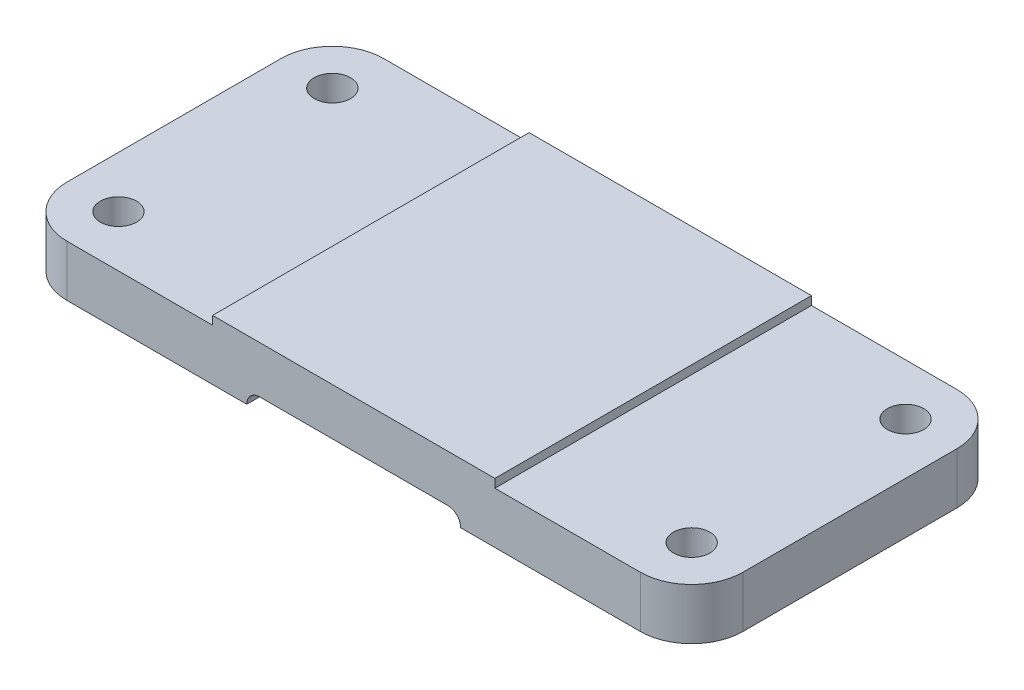
ISO-10303-21;
HEADER;
FILE_DESCRIPTION(('STEP AP214'),'2;1');
FILE_NAME('part.step','',(''),(''),'','','');
FILE_SCHEMA(('AUTOMOTIVE_DESIGN { 1 0 10303 214 1 1 1 1 }'));
ENDSEC;
DATA;
#1=APPLICATION_CONTEXT('core data for automotive mechanical design processes');
#2=APPLICATION_PROTOCOL_DEFINITION('international standard','automotive_design',2000,#1);
#3=PRODUCT_CONTEXT('',#1,'mechanical');
#4=PRODUCT('Part','Part','',(#3));
#5=PRODUCT_RELATED_PRODUCT_CATEGORY('part','',(#4));
#6=PRODUCT_DEFINITION_FORMATION('','',#4);
#7=PRODUCT_DEFINITION_CONTEXT('part definition',#1,'design');
#8=PRODUCT_DEFINITION('design','',#6,#7);
#9=PRODUCT_DEFINITION_SHAPE('','',#8);
#10=(LENGTH_UNIT() NAMED_UNIT(*) SI_UNIT(.MILLI.,.METRE.));
#11=(NAMED_UNIT(*) PLANE_ANGLE_UNIT() SI_UNIT($,.RADIAN.));
#12=(NAMED_UNIT(*) SI_UNIT($,.STERADIAN.) SOLID_ANGLE_UNIT());
#13=UNCERTAINTY_MEASURE_WITH_UNIT(LENGTH_MEASURE(1.E-05),#10,'distance_accuracy_value','');
#14=(GEOMETRIC_REPRESENTATION_CONTEXT(3) GLOBAL_UNCERTAINTY_ASSIGNED_CONTEXT((#13)) GLOBAL_UNIT_ASSIGNED_CONTEXT((#10,
#11,#12)) REPRESENTATION_CONTEXT('',''));
#15=CARTESIAN_POINT('',(0.,0.,0.));
#16=DIRECTION('',(0.,0.,1.));
#17=DIRECTION('',(1.,0.,0.));
#18=AXIS2_PLACEMENT_3D('',#15,#16,#17);
#19=CARTESIAN_POINT('',(0.,12.,0.));
#20=DIRECTION('',(0.,0.,-1.));
#21=DIRECTION('',(-1.,0.,0.));
#22=AXIS2_PLACEMENT_3D('',#19,#20,#21);
#23=PLANE('',#22);
#24=DIRECTION('',(1.,0.,0.));
#25=VECTOR('',#24,1.);
#26=CARTESIAN_POINT('',(0.,0.,0.));
#27=LINE('',#26,#25);
#28=CARTESIAN_POINT('',(12.0000000000001,0.,0.));
#29=VERTEX_POINT('',#28);
#30=CARTESIAN_POINT('',(54.,0.,0.));
#31=VERTEX_POINT('',#30);
#32=EDGE_CURVE('E174',#29,#31,#27,.T.);
#33=ORIENTED_EDGE('',*,*,#32,.T.);
#34=CARTESIAN_POINT('',(57.,0.,0.));
#35=DIRECTION('',(0.,0.,-1.));
#36=DIRECTION('',(-1.,0.,0.));
#37=AXIS2_PLACEMENT_3D('',#34,#35,#36);
#38=CIRCLE('',#37,3.);
#39=CARTESIAN_POINT('',(57.,3.,0.));
#40=VERTEX_POINT('',#39);
#41=EDGE_CURVE('E12',#31,#40,#38,.T.);
#42=ORIENTED_EDGE('',*,*,#41,.T.);
#43=DIRECTION('',(-1.,0.,0.));
#44=VECTOR('',#43,1.);
#45=CARTESIAN_POINT('',(104.,3.,0.));
#46=LINE('',#45,#44);
#47=CARTESIAN_POINT('',(101.,3.,0.));
#48=VERTEX_POINT('',#47);
#49=EDGE_CURVE('E161',#48,#40,#46,.T.);
#50=ORIENTED_EDGE('',*,*,#49,.F.);
#51=CARTESIAN_POINT('',(101.,0.,0.));
#52=DIRECTION('',(0.,0.,-1.));
#53=DIRECTION('',(-1.,0.,0.));
#54=AXIS2_PLACEMENT_3D('',#51,#52,#53);
#55=CIRCLE('',#54,3.);
#56=CARTESIAN_POINT('',(104.,0.,0.));
#57=VERTEX_POINT('',#56);
#58=EDGE_CURVE('E67',#48,#57,#55,.T.);
#59=ORIENTED_EDGE('',*,*,#58,.T.);
#60=CARTESIAN_POINT('',(146.,0.,0.));
#61=VERTEX_POINT('',#60);
#62=EDGE_CURVE('E159',#57,#61,#27,.T.);
#63=ORIENTED_EDGE('',*,*,#62,.T.);
#64=DIRECTION('',(0.,-1.,0.));
#65=VECTOR('',#64,1.);
#66=CARTESIAN_POINT('',(146.,12.,0.));
#67=LINE('',#66,#65);
#68=CARTESIAN_POINT('',(146.,12.,0.));
#69=VERTEX_POINT('',#68);
#70=EDGE_CURVE('E407',#69,#61,#67,.T.);
#71=ORIENTED_EDGE('',*,*,#70,.F.);
#72=DIRECTION('',(1.,0.,0.));
#73=VECTOR('',#72,1.);
#74=CARTESIAN_POINT('',(0.,12.,0.));
#75=LINE('',#74,#73);
#76=CARTESIAN_POINT('',(112.,12.,0.));
#77=VERTEX_POINT('',#76);
#78=EDGE_CURVE('E421',#77,#69,#75,.T.);
#79=ORIENTED_EDGE('',*,*,#78,.F.);
#80=DIRECTION('',(0.,1.,0.));
#81=VECTOR('',#80,1.);
#82=CARTESIAN_POINT('',(112.,12.,0.));
#83=LINE('',#82,#81);
#84=CARTESIAN_POINT('',(112.,14.,0.));
#85=VERTEX_POINT('',#84);
#86=EDGE_CURVE('E448',#77,#85,#83,.T.);
#87=ORIENTED_EDGE('',*,*,#86,.T.);
#88=DIRECTION('',(-1.,0.,0.));
#89=VECTOR('',#88,1.);
#90=CARTESIAN_POINT('',(112.,14.,0.));
#91=LINE('',#90,#89);
#92=CARTESIAN_POINT('',(46.,14.,0.));
#93=VERTEX_POINT('',#92);
#94=EDGE_CURVE('E401',#85,#93,#91,.T.);
#95=ORIENTED_EDGE('',*,*,#94,.T.);
#96=DIRECTION('',(0.,1.,0.));
#97=VECTOR('',#96,1.);
#98=CARTESIAN_POINT('',(46.,12.,0.));
#99=LINE('',#98,#97);
#100=CARTESIAN_POINT('',(46.,12.,0.));
#101=VERTEX_POINT('',#100);
#102=EDGE_CURVE('E460',#101,#93,#99,.T.);
#103=ORIENTED_EDGE('',*,*,#102,.F.);
#104=CARTESIAN_POINT('',(12.0000000000001,12.,0.));
#105=VERTEX_POINT('',#104);
#106=EDGE_CURVE('E418',#105,#101,#75,.T.);
#107=ORIENTED_EDGE('',*,*,#106,.F.);
#108=DIRECTION('',(0.,-1.,0.));
#109=VECTOR('',#108,1.);
#110=CARTESIAN_POINT('',(12.0000000000001,12.,0.));
#111=LINE('',#110,#109);
#112=EDGE_CURVE('E206',#105,#29,#111,.T.);
#113=ORIENTED_EDGE('',*,*,#112,.T.);
#114=EDGE_LOOP('',(#33,#42,#50,#59,#63,#71,#79,#87,#95,#103,#107,#113));
#115=FACE_BOUND('',#114,.T.);
#116=ADVANCED_FACE('F43',(#115),#23,.F.);
#117=CARTESIAN_POINT('',(0.,12.,-74.));
#118=DIRECTION('',(0.,0.,-1.));
#119=DIRECTION('',(-1.,0.,0.));
#120=AXIS2_PLACEMENT_3D('',#117,#118,#119);
#121=PLANE('',#120);
#122=DIRECTION('',(1.,0.,0.));
#123=VECTOR('',#122,1.);
#124=CARTESIAN_POINT('',(54.,3.,-74.));
#125=LINE('',#124,#123);
#126=CARTESIAN_POINT('',(57.,3.,-74.));
#127=VERTEX_POINT('',#126);
#128=CARTESIAN_POINT('',(101.,3.,-74.));
#129=VERTEX_POINT('',#128);
#130=EDGE_CURVE('E180',#127,#129,#125,.T.);
#131=ORIENTED_EDGE('',*,*,#130,.F.);
#132=CARTESIAN_POINT('',(57.,0.,-74.));
#133=DIRECTION('',(0.,0.,-1.));
#134=DIRECTION('',(-1.,0.,0.));
#135=AXIS2_PLACEMENT_3D('',#132,#133,#134);
#136=CIRCLE('',#135,3.);
#137=CARTESIAN_POINT('',(54.,0.,-74.));
#138=VERTEX_POINT('',#137);
#139=EDGE_CURVE('E53',#127,#138,#136,.F.);
#140=ORIENTED_EDGE('',*,*,#139,.T.);
#141=DIRECTION('',(1.,0.,0.));
#142=VECTOR('',#141,1.);
#143=CARTESIAN_POINT('',(0.,0.,-74.));
#144=LINE('',#143,#142);
#145=CARTESIAN_POINT('',(12.0000000000001,0.,-74.));
#146=VERTEX_POINT('',#145);
#147=EDGE_CURVE('E224',#146,#138,#144,.T.);
#148=ORIENTED_EDGE('',*,*,#147,.F.);
#149=DIRECTION('',(0.,-1.,0.));
#150=VECTOR('',#149,1.);
#151=CARTESIAN_POINT('',(12.0000000000001,12.,-74.));
#152=LINE('',#151,#150);
#153=CARTESIAN_POINT('',(12.0000000000001,12.,-74.));
#154=VERTEX_POINT('',#153);
#155=EDGE_CURVE('E512',#154,#146,#152,.T.);
#156=ORIENTED_EDGE('',*,*,#155,.F.);
#157=DIRECTION('',(1.,0.,0.));
#158=VECTOR('',#157,1.);
#159=CARTESIAN_POINT('',(0.,12.,-74.));
#160=LINE('',#159,#158);
#161=CARTESIAN_POINT('',(46.,12.,-74.));
#162=VERTEX_POINT('',#161);
#163=EDGE_CURVE('E382',#154,#162,#160,.T.);
#164=ORIENTED_EDGE('',*,*,#163,.T.);
#165=DIRECTION('',(0.,1.,0.));
#166=VECTOR('',#165,1.);
#167=CARTESIAN_POINT('',(46.,12.,-74.));
#168=LINE('',#167,#166);
#169=CARTESIAN_POINT('',(46.,14.,-74.));
#170=VERTEX_POINT('',#169);
#171=EDGE_CURVE('E481',#162,#170,#168,.T.);
#172=ORIENTED_EDGE('',*,*,#171,.T.);
#173=DIRECTION('',(1.,0.,0.));
#174=VECTOR('',#173,1.);
#175=CARTESIAN_POINT('',(46.,14.,-74.));
#176=LINE('',#175,#174);
#177=CARTESIAN_POINT('',(112.,14.,-74.));
#178=VERTEX_POINT('',#177);
#179=EDGE_CURVE('E442',#170,#178,#176,.T.);
#180=ORIENTED_EDGE('',*,*,#179,.T.);
#181=DIRECTION('',(0.,1.,0.));
#182=VECTOR('',#181,1.);
#183=CARTESIAN_POINT('',(112.,12.,-74.));
#184=LINE('',#183,#182);
#185=CARTESIAN_POINT('',(112.,12.,-74.));
#186=VERTEX_POINT('',#185);
#187=EDGE_CURVE('E440',#186,#178,#184,.T.);
#188=ORIENTED_EDGE('',*,*,#187,.F.);
#189=CARTESIAN_POINT('',(146.,12.,-74.));
#190=VERTEX_POINT('',#189);
#191=EDGE_CURVE('E378',#186,#190,#160,.T.);
#192=ORIENTED_EDGE('',*,*,#191,.T.);
#193=DIRECTION('',(0.,-1.,0.));
#194=VECTOR('',#193,1.);
#195=CARTESIAN_POINT('',(146.,12.,-74.));
#196=LINE('',#195,#194);
#197=CARTESIAN_POINT('',(146.,0.,-74.));
#198=VERTEX_POINT('',#197);
#199=EDGE_CURVE('E434',#190,#198,#196,.T.);
#200=ORIENTED_EDGE('',*,*,#199,.T.);
#201=CARTESIAN_POINT('',(104.,0.,-74.));
#202=VERTEX_POINT('',#201);
#203=EDGE_CURVE('E236',#202,#198,#144,.T.);
#204=ORIENTED_EDGE('',*,*,#203,.F.);
#205=CARTESIAN_POINT('',(101.,0.,-74.));
#206=DIRECTION('',(0.,0.,-1.));
#207=DIRECTION('',(-1.,0.,0.));
#208=AXIS2_PLACEMENT_3D('',#205,#206,#207);
#209=CIRCLE('',#208,3.);
#210=EDGE_CURVE('E163',#202,#129,#209,.F.);
#211=ORIENTED_EDGE('',*,*,#210,.T.);
#212=EDGE_LOOP('',(#131,#140,#148,#156,#164,#172,#180,#188,#192,#200,#204,#211));
#213=FACE_BOUND('',#212,.T.);
#214=ADVANCED_FACE('F223',(#213),#121,.T.);
#215=CARTESIAN_POINT('',(0.,0.,0.));
#216=DIRECTION('',(0.,1.,0.));
#217=DIRECTION('',(0.,0.,1.));
#218=AXIS2_PLACEMENT_3D('',#215,#216,#217);
#219=PLANE('',#218);
#220=CARTESIAN_POINT('',(12.,0.,-12.));
#221=DIRECTION('',(0.,1.,0.));
#222=DIRECTION('',(0.,0.,1.));
#223=AXIS2_PLACEMENT_3D('',#220,#221,#222);
#224=CIRCLE('',#223,4.24999999999999);
#225=CARTESIAN_POINT('',(12.,0.,-7.75000000000001));
#226=VERTEX_POINT('',#225);
#227=EDGE_CURVE('E248',#226,#226,#224,.T.);
#228=ORIENTED_EDGE('',*,*,#227,.T.);
#229=EDGE_LOOP('',(#228));
#230=FACE_BOUND('',#229,.T.);
#231=CARTESIAN_POINT('',(12.,0.,-62.));
#232=DIRECTION('',(0.,1.,0.));
#233=DIRECTION('',(0.,0.,1.));
#234=AXIS2_PLACEMENT_3D('',#231,#232,#233);
#235=CIRCLE('',#234,4.24999999999999);
#236=CARTESIAN_POINT('',(12.,0.,-57.75));
#237=VERTEX_POINT('',#236);
#238=EDGE_CURVE('E239',#237,#237,#235,.T.);
#239=ORIENTED_EDGE('',*,*,#238,.T.);
#240=EDGE_LOOP('',(#239));
#241=FACE_BOUND('',#240,.T.);
#242=DIRECTION('',(0.,0.,-1.));
#243=VECTOR('',#242,1.);
#244=CARTESIAN_POINT('',(54.,0.,0.));
#245=LINE('',#244,#243);
#246=EDGE_CURVE('E187',#31,#138,#245,.T.);
#247=ORIENTED_EDGE('',*,*,#246,.F.);
#248=ORIENTED_EDGE('',*,*,#32,.F.);
#249=CARTESIAN_POINT('',(12.,0.,-12.));
#250=DIRECTION('',(0.,1.,0.));
#251=DIRECTION('',(0.,0.,1.));
#252=AXIS2_PLACEMENT_3D('',#249,#250,#251);
#253=CIRCLE('',#252,12.);
#254=CARTESIAN_POINT('',(0.,0.,-12.0000000000001));
#255=VERTEX_POINT('',#254);
#256=EDGE_CURVE('E175',#29,#255,#253,.F.);
#257=ORIENTED_EDGE('',*,*,#256,.T.);
#258=DIRECTION('',(0.,0.,-1.));
#259=VECTOR('',#258,1.);
#260=CARTESIAN_POINT('',(0.,0.,0.));
#261=LINE('',#260,#259);
#262=CARTESIAN_POINT('',(0.,0.,-61.9999999999999));
#263=VERTEX_POINT('',#262);
#264=EDGE_CURVE('E500',#255,#263,#261,.T.);
#265=ORIENTED_EDGE('',*,*,#264,.T.);
#266=CARTESIAN_POINT('',(12.,0.,-62.));
#267=DIRECTION('',(0.,1.,0.));
#268=DIRECTION('',(0.,0.,1.));
#269=AXIS2_PLACEMENT_3D('',#266,#267,#268);
#270=CIRCLE('',#269,12.);
#271=EDGE_CURVE('E234',#263,#146,#270,.F.);
#272=ORIENTED_EDGE('',*,*,#271,.T.);
#273=ORIENTED_EDGE('',*,*,#147,.T.);
#274=EDGE_LOOP('',(#247,#248,#257,#265,#272,#273));
#275=FACE_BOUND('',#274,.T.);
#276=ADVANCED_FACE('F230',(#230,#241,#275),#219,.F.);
#277=CARTESIAN_POINT('',(146.,0.,-12.));
#278=DIRECTION('',(0.,1.,0.));
#279=DIRECTION('',(0.,0.,1.));
#280=AXIS2_PLACEMENT_3D('',#277,#278,#279);
#281=CIRCLE('',#280,4.24999999999998);
#282=CARTESIAN_POINT('',(146.,0.,-7.75000000000003));
#283=VERTEX_POINT('',#282);
#284=EDGE_CURVE('E47',#283,#283,#281,.T.);
#285=ORIENTED_EDGE('',*,*,#284,.T.);
#286=EDGE_LOOP('',(#285));
#287=FACE_BOUND('',#286,.T.);
#288=CARTESIAN_POINT('',(146.,0.,-62.));
#289=DIRECTION('',(0.,1.,0.));
#290=DIRECTION('',(0.,0.,1.));
#291=AXIS2_PLACEMENT_3D('',#288,#289,#290);
#292=CIRCLE('',#291,4.24999999999998);
#293=CARTESIAN_POINT('',(146.,0.,-57.75));
#294=VERTEX_POINT('',#293);
#295=EDGE_CURVE('E256',#294,#294,#292,.T.);
#296=ORIENTED_EDGE('',*,*,#295,.T.);
#297=EDGE_LOOP('',(#296));
#298=FACE_BOUND('',#297,.T.);
#299=DIRECTION('',(0.,0.,1.));
#300=VECTOR('',#299,1.);
#301=CARTESIAN_POINT('',(104.,0.,-74.));
#302=LINE('',#301,#300);
#303=EDGE_CURVE('E169',#202,#57,#302,.T.);
#304=ORIENTED_EDGE('',*,*,#303,.F.);
#305=ORIENTED_EDGE('',*,*,#203,.T.);
#306=CARTESIAN_POINT('',(146.,0.,-62.));
#307=DIRECTION('',(0.,1.,0.));
#308=DIRECTION('',(0.,0.,1.));
#309=AXIS2_PLACEMENT_3D('',#306,#307,#308);
#310=CIRCLE('',#309,12.);
#311=CARTESIAN_POINT('',(158.,0.,-61.9999999999999));
#312=VERTEX_POINT('',#311);
#313=EDGE_CURVE('E362',#198,#312,#310,.F.);
#314=ORIENTED_EDGE('',*,*,#313,.T.);
#315=DIRECTION('',(0.,0.,-1.));
#316=VECTOR('',#315,1.);
#317=CARTESIAN_POINT('',(158.,0.,0.));
#318=LINE('',#317,#316);
#319=CARTESIAN_POINT('',(158.,0.,-12.0000000000001));
#320=VERTEX_POINT('',#319);
#321=EDGE_CURVE('E354',#320,#312,#318,.T.);
#322=ORIENTED_EDGE('',*,*,#321,.F.);
#323=CARTESIAN_POINT('',(146.,0.,-12.));
#324=DIRECTION('',(0.,1.,0.));
#325=DIRECTION('',(0.,0.,1.));
#326=AXIS2_PLACEMENT_3D('',#323,#324,#325);
#327=CIRCLE('',#326,12.);
#328=EDGE_CURVE('E172',#61,#320,#327,.T.);
#329=ORIENTED_EDGE('',*,*,#328,.F.);
#330=ORIENTED_EDGE('',*,*,#62,.F.);
#331=EDGE_LOOP('',(#304,#305,#314,#322,#329,#330));
#332=FACE_BOUND('',#331,.T.);
#333=ADVANCED_FACE('F168',(#287,#298,#332),#219,.F.);
#334=CARTESIAN_POINT('',(0.,12.,0.));
#335=DIRECTION('',(0.,1.,0.));
#336=DIRECTION('',(0.,0.,1.));
#337=AXIS2_PLACEMENT_3D('',#334,#335,#336);
#338=PLANE('',#337);
#339=CARTESIAN_POINT('',(12.,12.,-12.));
#340=DIRECTION('',(0.,1.,0.));
#341=DIRECTION('',(0.,0.,1.));
#342=AXIS2_PLACEMENT_3D('',#339,#340,#341);
#343=CIRCLE('',#342,4.24999999999999);
#344=CARTESIAN_POINT('',(12.,12.,-7.75000000000001));
#345=VERTEX_POINT('',#344);
#346=EDGE_CURVE('E252',#345,#345,#343,.T.);
#347=ORIENTED_EDGE('',*,*,#346,.F.);
#348=EDGE_LOOP('',(#347));
#349=FACE_BOUND('',#348,.T.);
#350=CARTESIAN_POINT('',(12.,12.,-62.));
#351=DIRECTION('',(0.,1.,0.));
#352=DIRECTION('',(0.,0.,1.));
#353=AXIS2_PLACEMENT_3D('',#350,#351,#352);
#354=CIRCLE('',#353,4.24999999999999);
#355=CARTESIAN_POINT('',(12.,12.,-57.75));
#356=VERTEX_POINT('',#355);
#357=EDGE_CURVE('E242',#356,#356,#354,.T.);
#358=ORIENTED_EDGE('',*,*,#357,.F.);
#359=EDGE_LOOP('',(#358));
#360=FACE_BOUND('',#359,.T.);
#361=ORIENTED_EDGE('',*,*,#106,.T.);
#362=DIRECTION('',(0.,0.,-1.));
#363=VECTOR('',#362,1.);
#364=CARTESIAN_POINT('',(46.,12.,0.));
#365=LINE('',#364,#363);
#366=EDGE_CURVE('E457',#101,#162,#365,.T.);
#367=ORIENTED_EDGE('',*,*,#366,.T.);
#368=ORIENTED_EDGE('',*,*,#163,.F.);
#369=CARTESIAN_POINT('',(12.,12.,-62.));
#370=DIRECTION('',(0.,1.,0.));
#371=DIRECTION('',(0.,0.,1.));
#372=AXIS2_PLACEMENT_3D('',#369,#370,#371);
#373=CIRCLE('',#372,12.);
#374=CARTESIAN_POINT('',(0.,12.,-61.9999999999999));
#375=VERTEX_POINT('',#374);
#376=EDGE_CURVE('E389',#375,#154,#373,.F.);
#377=ORIENTED_EDGE('',*,*,#376,.F.);
#378=DIRECTION('',(0.,0.,-1.));
#379=VECTOR('',#378,1.);
#380=CARTESIAN_POINT('',(0.,12.,0.));
#381=LINE('',#380,#379);
#382=CARTESIAN_POINT('',(0.,12.,-12.0000000000001));
#383=VERTEX_POINT('',#382);
#384=EDGE_CURVE('E394',#383,#375,#381,.T.);
#385=ORIENTED_EDGE('',*,*,#384,.F.);
#386=CARTESIAN_POINT('',(12.,12.,-12.));
#387=DIRECTION('',(0.,1.,0.));
#388=DIRECTION('',(0.,0.,1.));
#389=AXIS2_PLACEMENT_3D('',#386,#387,#388);
#390=CIRCLE('',#389,12.);
#391=EDGE_CURVE('E425',#105,#383,#390,.F.);
#392=ORIENTED_EDGE('',*,*,#391,.F.);
#393=EDGE_LOOP('',(#361,#367,#368,#377,#385,#392));
#394=FACE_BOUND('',#393,.T.);
#395=ADVANCED_FACE('F297',(#349,#360,#394),#338,.T.);
#396=CARTESIAN_POINT('',(12.,12.,-12.));
#397=DIRECTION('',(0.,-1.,0.));
#398=DIRECTION('',(0.,0.,-1.));
#399=AXIS2_PLACEMENT_3D('',#396,#397,#398);
#400=CYLINDRICAL_SURFACE('',#399,12.);
#401=ORIENTED_EDGE('',*,*,#256,.F.);
#402=ORIENTED_EDGE('',*,*,#112,.F.);
#403=ORIENTED_EDGE('',*,*,#391,.T.);
#404=DIRECTION('',(0.,-1.,0.));
#405=VECTOR('',#404,1.);
#406=CARTESIAN_POINT('',(0.,12.,-12.0000000000001));
#407=LINE('',#406,#405);
#408=EDGE_CURVE('E398',#383,#255,#407,.T.);
#409=ORIENTED_EDGE('',*,*,#408,.T.);
#410=EDGE_LOOP('',(#401,#402,#403,#409));
#411=FACE_BOUND('',#410,.T.);
#412=ADVANCED_FACE('F295',(#411),#400,.T.);
#413=CARTESIAN_POINT('',(146.,12.,-12.));
#414=DIRECTION('',(0.,-1.,0.));
#415=DIRECTION('',(0.,0.,-1.));
#416=AXIS2_PLACEMENT_3D('',#413,#414,#415);
#417=CYLINDRICAL_SURFACE('',#416,12.);
#418=ORIENTED_EDGE('',*,*,#328,.T.);
#419=DIRECTION('',(0.,-1.,0.));
#420=VECTOR('',#419,1.);
#421=CARTESIAN_POINT('',(158.,12.,-12.0000000000001));
#422=LINE('',#421,#420);
#423=CARTESIAN_POINT('',(158.,12.,-12.0000000000001));
#424=VERTEX_POINT('',#423);
#425=EDGE_CURVE('E360',#424,#320,#422,.T.);
#426=ORIENTED_EDGE('',*,*,#425,.F.);
#427=CARTESIAN_POINT('',(146.,12.,-12.));
#428=DIRECTION('',(0.,1.,0.));
#429=DIRECTION('',(0.,0.,1.));
#430=AXIS2_PLACEMENT_3D('',#427,#428,#429);
#431=CIRCLE('',#430,12.);
#432=EDGE_CURVE('E408',#69,#424,#431,.T.);
#433=ORIENTED_EDGE('',*,*,#432,.F.);
#434=ORIENTED_EDGE('',*,*,#70,.T.);
#435=EDGE_LOOP('',(#418,#426,#433,#434));
#436=FACE_BOUND('',#435,.T.);
#437=ADVANCED_FACE('F293',(#436),#417,.T.);
#438=CARTESIAN_POINT('',(158.,12.,0.));
#439=DIRECTION('',(-1.,0.,0.));
#440=DIRECTION('',(0.,0.,1.));
#441=AXIS2_PLACEMENT_3D('',#438,#439,#440);
#442=PLANE('',#441);
#443=ORIENTED_EDGE('',*,*,#321,.T.);
#444=DIRECTION('',(0.,-1.,0.));
#445=VECTOR('',#444,1.);
#446=CARTESIAN_POINT('',(158.,12.,-61.9999999999999));
#447=LINE('',#446,#445);
#448=CARTESIAN_POINT('',(158.,12.,-61.9999999999999));
#449=VERTEX_POINT('',#448);
#450=EDGE_CURVE('E357',#449,#312,#447,.T.);
#451=ORIENTED_EDGE('',*,*,#450,.F.);
#452=DIRECTION('',(0.,0.,-1.));
#453=VECTOR('',#452,1.);
#454=CARTESIAN_POINT('',(158.,12.,0.));
#455=LINE('',#454,#453);
#456=EDGE_CURVE('E429',#424,#449,#455,.T.);
#457=ORIENTED_EDGE('',*,*,#456,.F.);
#458=ORIENTED_EDGE('',*,*,#425,.T.);
#459=EDGE_LOOP('',(#443,#451,#457,#458));
#460=FACE_BOUND('',#459,.T.);
#461=ADVANCED_FACE('F343',(#460),#442,.F.);
#462=CARTESIAN_POINT('',(146.,12.,-62.));
#463=DIRECTION('',(0.,-1.,0.));
#464=DIRECTION('',(0.,0.,-1.));
#465=AXIS2_PLACEMENT_3D('',#462,#463,#464);
#466=CYLINDRICAL_SURFACE('',#465,12.);
#467=ORIENTED_EDGE('',*,*,#313,.F.);
#468=ORIENTED_EDGE('',*,*,#199,.F.);
#469=CARTESIAN_POINT('',(146.,12.,-62.));
#470=DIRECTION('',(0.,1.,0.));
#471=DIRECTION('',(0.,0.,1.));
#472=AXIS2_PLACEMENT_3D('',#469,#470,#471);
#473=CIRCLE('',#472,12.);
#474=EDGE_CURVE('E383',#190,#449,#473,.F.);
#475=ORIENTED_EDGE('',*,*,#474,.T.);
#476=ORIENTED_EDGE('',*,*,#450,.T.);
#477=EDGE_LOOP('',(#467,#468,#475,#476));
#478=FACE_BOUND('',#477,.T.);
#479=ADVANCED_FACE('F339',(#478),#466,.T.);
#480=CARTESIAN_POINT('',(12.,12.,-62.));
#481=DIRECTION('',(0.,-1.,0.));
#482=DIRECTION('',(0.,0.,-1.));
#483=AXIS2_PLACEMENT_3D('',#480,#481,#482);
#484=CYLINDRICAL_SURFACE('',#483,12.);
#485=ORIENTED_EDGE('',*,*,#271,.F.);
#486=DIRECTION('',(0.,-1.,0.));
#487=VECTOR('',#486,1.);
#488=CARTESIAN_POINT('',(0.,12.,-61.9999999999999));
#489=LINE('',#488,#487);
#490=EDGE_CURVE('E509',#375,#263,#489,.T.);
#491=ORIENTED_EDGE('',*,*,#490,.F.);
#492=ORIENTED_EDGE('',*,*,#376,.T.);
#493=ORIENTED_EDGE('',*,*,#155,.T.);
#494=EDGE_LOOP('',(#485,#491,#492,#493));
#495=FACE_BOUND('',#494,.T.);
#496=ADVANCED_FACE('F336',(#495),#484,.T.);
#497=CARTESIAN_POINT('',(0.,12.,0.));
#498=DIRECTION('',(-1.,0.,0.));
#499=DIRECTION('',(0.,0.,1.));
#500=AXIS2_PLACEMENT_3D('',#497,#498,#499);
#501=PLANE('',#500);
#502=ORIENTED_EDGE('',*,*,#264,.F.);
#503=ORIENTED_EDGE('',*,*,#408,.F.);
#504=ORIENTED_EDGE('',*,*,#384,.T.);
#505=ORIENTED_EDGE('',*,*,#490,.T.);
#506=EDGE_LOOP('',(#502,#503,#504,#505));
#507=FACE_BOUND('',#506,.T.);
#508=ADVANCED_FACE('F327',(#507),#501,.T.);
#509=CARTESIAN_POINT('',(146.,12.,-12.));
#510=DIRECTION('',(0.,1.,0.));
#511=DIRECTION('',(0.,0.,1.));
#512=AXIS2_PLACEMENT_3D('',#509,#510,#511);
#513=CIRCLE('',#512,4.24999999999998);
#514=CARTESIAN_POINT('',(146.,12.,-7.75000000000003));
#515=VERTEX_POINT('',#514);
#516=EDGE_CURVE('E264',#515,#515,#513,.T.);
#517=ORIENTED_EDGE('',*,*,#516,.F.);
#518=EDGE_LOOP('',(#517));
#519=FACE_BOUND('',#518,.T.);
#520=CARTESIAN_POINT('',(146.,12.,-62.));
#521=DIRECTION('',(0.,1.,0.));
#522=DIRECTION('',(0.,0.,1.));
#523=AXIS2_PLACEMENT_3D('',#520,#521,#522);
#524=CIRCLE('',#523,4.24999999999998);
#525=CARTESIAN_POINT('',(146.,12.,-57.75));
#526=VERTEX_POINT('',#525);
#527=EDGE_CURVE('E260',#526,#526,#524,.T.);
#528=ORIENTED_EDGE('',*,*,#527,.F.);
#529=EDGE_LOOP('',(#528));
#530=FACE_BOUND('',#529,.T.);
#531=DIRECTION('',(0.,0.,-1.));
#532=VECTOR('',#531,1.);
#533=CARTESIAN_POINT('',(112.,12.,0.));
#534=LINE('',#533,#532);
#535=EDGE_CURVE('E437',#77,#186,#534,.T.);
#536=ORIENTED_EDGE('',*,*,#535,.F.);
#537=ORIENTED_EDGE('',*,*,#78,.T.);
#538=ORIENTED_EDGE('',*,*,#432,.T.);
#539=ORIENTED_EDGE('',*,*,#456,.T.);
#540=ORIENTED_EDGE('',*,*,#474,.F.);
#541=ORIENTED_EDGE('',*,*,#191,.F.);
#542=EDGE_LOOP('',(#536,#537,#538,#539,#540,#541));
#543=FACE_BOUND('',#542,.T.);
#544=ADVANCED_FACE('F316',(#519,#530,#543),#338,.T.);
#545=CARTESIAN_POINT('',(0.,14.,0.));
#546=DIRECTION('',(0.,1.,0.));
#547=DIRECTION('',(0.,0.,1.));
#548=AXIS2_PLACEMENT_3D('',#545,#546,#547);
#549=PLANE('',#548);
#550=ORIENTED_EDGE('',*,*,#94,.F.);
#551=DIRECTION('',(0.,0.,-1.));
#552=VECTOR('',#551,1.);
#553=CARTESIAN_POINT('',(112.,14.,0.));
#554=LINE('',#553,#552);
#555=EDGE_CURVE('E185',#85,#178,#554,.T.);
#556=ORIENTED_EDGE('',*,*,#555,.T.);
#557=ORIENTED_EDGE('',*,*,#179,.F.);
#558=DIRECTION('',(0.,0.,-1.));
#559=VECTOR('',#558,1.);
#560=CARTESIAN_POINT('',(46.,14.,0.));
#561=LINE('',#560,#559);
#562=EDGE_CURVE('E466',#93,#170,#561,.T.);
#563=ORIENTED_EDGE('',*,*,#562,.F.);
#564=EDGE_LOOP('',(#550,#556,#557,#563));
#565=FACE_BOUND('',#564,.T.);
#566=ADVANCED_FACE('F309',(#565),#549,.T.);
#567=CARTESIAN_POINT('',(112.,12.,0.));
#568=DIRECTION('',(1.,0.,0.));
#569=DIRECTION('',(0.,0.,-1.));
#570=AXIS2_PLACEMENT_3D('',#567,#568,#569);
#571=PLANE('',#570);
#572=ORIENTED_EDGE('',*,*,#555,.F.);
#573=ORIENTED_EDGE('',*,*,#86,.F.);
#574=ORIENTED_EDGE('',*,*,#535,.T.);
#575=ORIENTED_EDGE('',*,*,#187,.T.);
#576=EDGE_LOOP('',(#572,#573,#574,#575));
#577=FACE_BOUND('',#576,.T.);
#578=ADVANCED_FACE('F313',(#577),#571,.T.);
#579=CARTESIAN_POINT('',(46.,12.,0.));
#580=DIRECTION('',(1.,0.,0.));
#581=DIRECTION('',(0.,0.,-1.));
#582=AXIS2_PLACEMENT_3D('',#579,#580,#581);
#583=PLANE('',#582);
#584=ORIENTED_EDGE('',*,*,#562,.T.);
#585=ORIENTED_EDGE('',*,*,#171,.F.);
#586=ORIENTED_EDGE('',*,*,#366,.F.);
#587=ORIENTED_EDGE('',*,*,#102,.T.);
#588=EDGE_LOOP('',(#584,#585,#586,#587));
#589=FACE_BOUND('',#588,.T.);
#590=ADVANCED_FACE('F306',(#589),#583,.F.);
#591=CARTESIAN_POINT('',(0.,3.,0.));
#592=DIRECTION('',(0.,1.,0.));
#593=DIRECTION('',(0.,0.,1.));
#594=AXIS2_PLACEMENT_3D('',#591,#592,#593);
#595=PLANE('',#594);
#596=ORIENTED_EDGE('',*,*,#130,.T.);
#597=DIRECTION('',(0.,0.,1.));
#598=VECTOR('',#597,1.);
#599=CARTESIAN_POINT('',(101.,3.,0.));
#600=LINE('',#599,#598);
#601=EDGE_CURVE('E164',#129,#48,#600,.T.);
#602=ORIENTED_EDGE('',*,*,#601,.T.);
#603=ORIENTED_EDGE('',*,*,#49,.T.);
#604=DIRECTION('',(0.,0.,-1.));
#605=VECTOR('',#604,1.);
#606=CARTESIAN_POINT('',(57.,3.,0.));
#607=LINE('',#606,#605);
#608=EDGE_CURVE('E202',#40,#127,#607,.T.);
#609=ORIENTED_EDGE('',*,*,#608,.T.);
#610=EDGE_LOOP('',(#596,#602,#603,#609));
#611=FACE_BOUND('',#610,.T.);
#612=ADVANCED_FACE('F300',(#611),#595,.F.);
#613=CARTESIAN_POINT('',(101.,0.,0.));
#614=DIRECTION('',(0.,0.,1.));
#615=DIRECTION('',(1.,0.,0.));
#616=AXIS2_PLACEMENT_3D('',#613,#614,#615);
#617=CYLINDRICAL_SURFACE('',#616,3.);
#618=ORIENTED_EDGE('',*,*,#210,.F.);
#619=ORIENTED_EDGE('',*,*,#303,.T.);
#620=ORIENTED_EDGE('',*,*,#58,.F.);
#621=ORIENTED_EDGE('',*,*,#601,.F.);
#622=EDGE_LOOP('',(#618,#619,#620,#621));
#623=FACE_BOUND('',#622,.T.);
#624=ADVANCED_FACE('F178',(#623),#617,.F.);
#625=CARTESIAN_POINT('',(57.,0.,0.));
#626=DIRECTION('',(0.,0.,-1.));
#627=DIRECTION('',(-1.,0.,0.));
#628=AXIS2_PLACEMENT_3D('',#625,#626,#627);
#629=CYLINDRICAL_SURFACE('',#628,3.);
#630=ORIENTED_EDGE('',*,*,#41,.F.);
#631=ORIENTED_EDGE('',*,*,#246,.T.);
#632=ORIENTED_EDGE('',*,*,#139,.F.);
#633=ORIENTED_EDGE('',*,*,#608,.F.);
#634=EDGE_LOOP('',(#630,#631,#632,#633));
#635=FACE_BOUND('',#634,.T.);
#636=ADVANCED_FACE('F45',(#635),#629,.F.);
#637=CARTESIAN_POINT('',(12.,12.,-62.));
#638=DIRECTION('',(0.,1.,0.));
#639=DIRECTION('',(0.,0.,1.));
#640=AXIS2_PLACEMENT_3D('',#637,#638,#639);
#641=CYLINDRICAL_SURFACE('',#640,4.24999999999999);
#642=ORIENTED_EDGE('',*,*,#357,.T.);
#643=EDGE_LOOP('',(#642));
#644=FACE_BOUND('',#643,.T.);
#645=ORIENTED_EDGE('',*,*,#238,.F.);
#646=EDGE_LOOP('',(#645));
#647=FACE_BOUND('',#646,.T.);
#648=ADVANCED_FACE('F305',(#644,#647),#641,.F.);
#649=CARTESIAN_POINT('',(12.,12.,-12.));
#650=DIRECTION('',(0.,1.,0.));
#651=DIRECTION('',(0.,0.,1.));
#652=AXIS2_PLACEMENT_3D('',#649,#650,#651);
#653=CYLINDRICAL_SURFACE('',#652,4.24999999999999);
#654=ORIENTED_EDGE('',*,*,#346,.T.);
#655=EDGE_LOOP('',(#654));
#656=FACE_BOUND('',#655,.T.);
#657=ORIENTED_EDGE('',*,*,#227,.F.);
#658=EDGE_LOOP('',(#657));
#659=FACE_BOUND('',#658,.T.);
#660=ADVANCED_FACE('F282',(#656,#659),#653,.F.);
#661=CARTESIAN_POINT('',(146.,12.,-62.));
#662=DIRECTION('',(0.,1.,0.));
#663=DIRECTION('',(0.,0.,1.));
#664=AXIS2_PLACEMENT_3D('',#661,#662,#663);
#665=CYLINDRICAL_SURFACE('',#664,4.24999999999998);
#666=ORIENTED_EDGE('',*,*,#527,.T.);
#667=EDGE_LOOP('',(#666));
#668=FACE_BOUND('',#667,.T.);
#669=ORIENTED_EDGE('',*,*,#295,.F.);
#670=EDGE_LOOP('',(#669));
#671=FACE_BOUND('',#670,.T.);
#672=ADVANCED_FACE('F277',(#668,#671),#665,.F.);
#673=CARTESIAN_POINT('',(146.,12.,-12.));
#674=DIRECTION('',(0.,1.,0.));
#675=DIRECTION('',(0.,0.,1.));
#676=AXIS2_PLACEMENT_3D('',#673,#674,#675);
#677=CYLINDRICAL_SURFACE('',#676,4.24999999999998);
#678=ORIENTED_EDGE('',*,*,#516,.T.);
#679=EDGE_LOOP('',(#678));
#680=FACE_BOUND('',#679,.T.);
#681=ORIENTED_EDGE('',*,*,#284,.F.);
#682=EDGE_LOOP('',(#681));
#683=FACE_BOUND('',#682,.T.);
#684=ADVANCED_FACE('F275',(#680,#683),#677,.F.);
#685=CLOSED_SHELL('',(#116,#214,#276,#333,#395,#412,#437,#461,#479,#496,#508,#544,#566,#578,
#590,#612,#624,#636,#648,#660,#672,#684));
#686=MANIFOLD_SOLID_BREP('B2',#685);
#687=ADVANCED_BREP_SHAPE_REPRESENTATION('',(#18,#686),#14);
#688=SHAPE_DEFINITION_REPRESENTATION(#9,#687);
ENDSEC;
END-ISO-10303-21;
